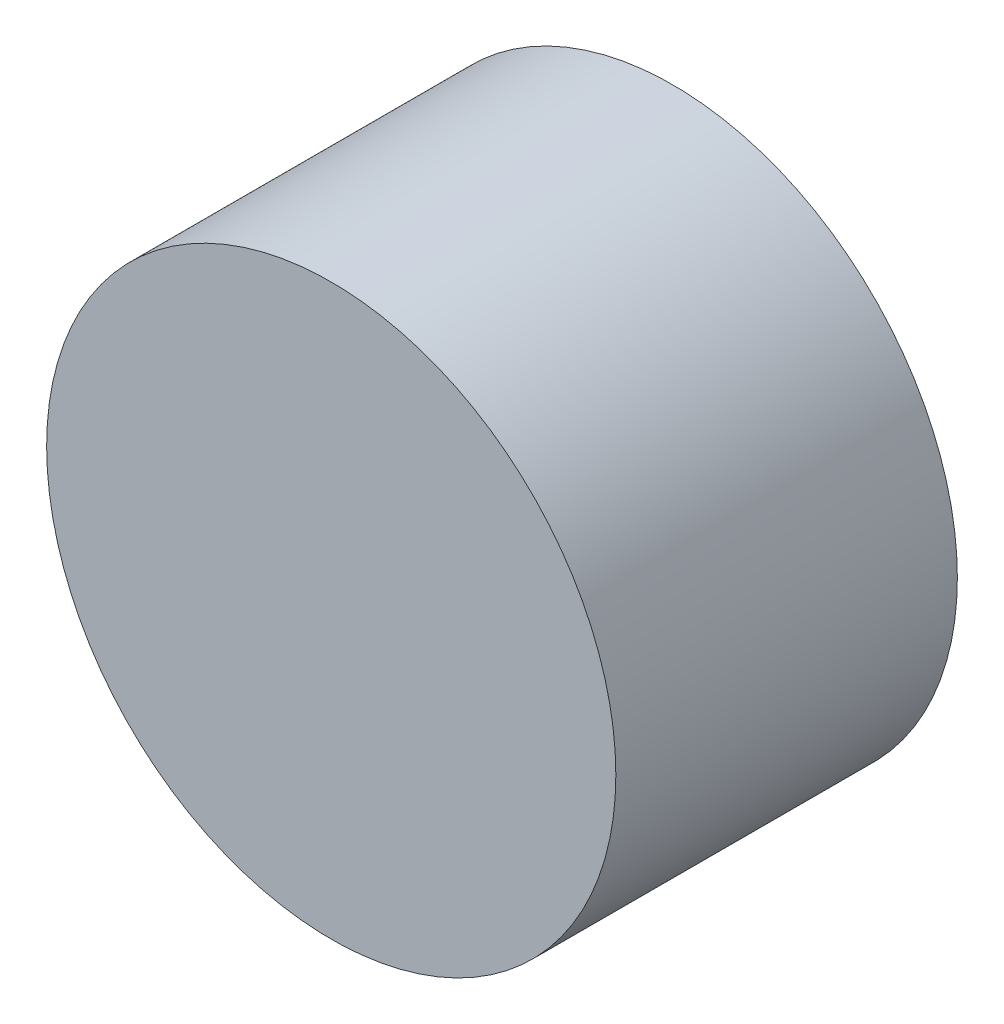
ISO-10303-21;
HEADER;
FILE_DESCRIPTION(('STEP AP214'),'2;1');
FILE_NAME('part.step','',(''),(''),'','','');
FILE_SCHEMA(('AUTOMOTIVE_DESIGN { 1 0 10303 214 1 1 1 1 }'));
ENDSEC;
DATA;
#1=APPLICATION_CONTEXT('core data for automotive mechanical design processes');
#2=APPLICATION_PROTOCOL_DEFINITION('international standard','automotive_design',2000,#1);
#3=PRODUCT_CONTEXT('',#1,'mechanical');
#4=PRODUCT('Part','Part','',(#3));
#5=PRODUCT_RELATED_PRODUCT_CATEGORY('part','',(#4));
#6=PRODUCT_DEFINITION_FORMATION('','',#4);
#7=PRODUCT_DEFINITION_CONTEXT('part definition',#1,'design');
#8=PRODUCT_DEFINITION('design','',#6,#7);
#9=PRODUCT_DEFINITION_SHAPE('','',#8);
#10=(LENGTH_UNIT() NAMED_UNIT(*) SI_UNIT(.MILLI.,.METRE.));
#11=(NAMED_UNIT(*) PLANE_ANGLE_UNIT() SI_UNIT($,.RADIAN.));
#12=(NAMED_UNIT(*) SI_UNIT($,.STERADIAN.) SOLID_ANGLE_UNIT());
#13=UNCERTAINTY_MEASURE_WITH_UNIT(LENGTH_MEASURE(1.E-05),#10,'distance_accuracy_value','');
#14=(GEOMETRIC_REPRESENTATION_CONTEXT(3) GLOBAL_UNCERTAINTY_ASSIGNED_CONTEXT((#13)) GLOBAL_UNIT_ASSIGNED_CONTEXT((#10,
#11,#12)) REPRESENTATION_CONTEXT('',''));
#15=CARTESIAN_POINT('',(0.,0.,0.));
#16=DIRECTION('',(0.,0.,1.));
#17=DIRECTION('',(1.,0.,0.));
#18=AXIS2_PLACEMENT_3D('',#15,#16,#17);
#19=CARTESIAN_POINT('',(0.,0.,1.5));
#20=DIRECTION('',(0.,0.,-1.));
#21=DIRECTION('',(-1.,0.,0.));
#22=AXIS2_PLACEMENT_3D('',#19,#20,#21);
#23=CYLINDRICAL_SURFACE('',#22,2.5);
#24=CARTESIAN_POINT('',(0.,0.,1.5));
#25=DIRECTION('',(0.,0.,1.));
#26=DIRECTION('',(1.,0.,0.));
#27=AXIS2_PLACEMENT_3D('',#24,#25,#26);
#28=CIRCLE('',#27,2.5);
#29=CARTESIAN_POINT('',(2.5,0.,1.5));
#30=VERTEX_POINT('',#29);
#31=EDGE_CURVE('E10',#30,#30,#28,.T.);
#32=ORIENTED_EDGE('',*,*,#31,.F.);
#33=EDGE_LOOP('',(#32));
#34=FACE_BOUND('',#33,.T.);
#35=CARTESIAN_POINT('',(0.,0.,-1.5));
#36=DIRECTION('',(0.,0.,1.));
#37=DIRECTION('',(1.,0.,0.));
#38=AXIS2_PLACEMENT_3D('',#35,#36,#37);
#39=CIRCLE('',#38,2.5);
#40=CARTESIAN_POINT('',(2.5,0.,-1.5));
#41=VERTEX_POINT('',#40);
#42=EDGE_CURVE('E33',#41,#41,#39,.T.);
#43=ORIENTED_EDGE('',*,*,#42,.T.);
#44=EDGE_LOOP('',(#43));
#45=FACE_BOUND('',#44,.T.);
#46=ADVANCED_FACE('F30',(#34,#45),#23,.T.);
#47=CARTESIAN_POINT('',(0.,0.,1.5));
#48=DIRECTION('',(0.,0.,1.));
#49=DIRECTION('',(1.,0.,0.));
#50=AXIS2_PLACEMENT_3D('',#47,#48,#49);
#51=PLANE('',#50);
#52=ORIENTED_EDGE('',*,*,#31,.T.);
#53=EDGE_LOOP('',(#52));
#54=FACE_BOUND('',#53,.T.);
#55=ADVANCED_FACE('F45',(#54),#51,.T.);
#56=CARTESIAN_POINT('',(0.,0.,-1.5));
#57=DIRECTION('',(0.,0.,1.));
#58=DIRECTION('',(1.,0.,0.));
#59=AXIS2_PLACEMENT_3D('',#56,#57,#58);
#60=PLANE('',#59);
#61=ORIENTED_EDGE('',*,*,#42,.F.);
#62=EDGE_LOOP('',(#61));
#63=FACE_BOUND('',#62,.T.);
#64=ADVANCED_FACE('F43',(#63),#60,.F.);
#65=CLOSED_SHELL('',(#46,#55,#64));
#66=MANIFOLD_SOLID_BREP('B2',#65);
#67=ADVANCED_BREP_SHAPE_REPRESENTATION('',(#18,#66),#14);
#68=SHAPE_DEFINITION_REPRESENTATION(#9,#67);
ENDSEC;
END-ISO-10303-21;
